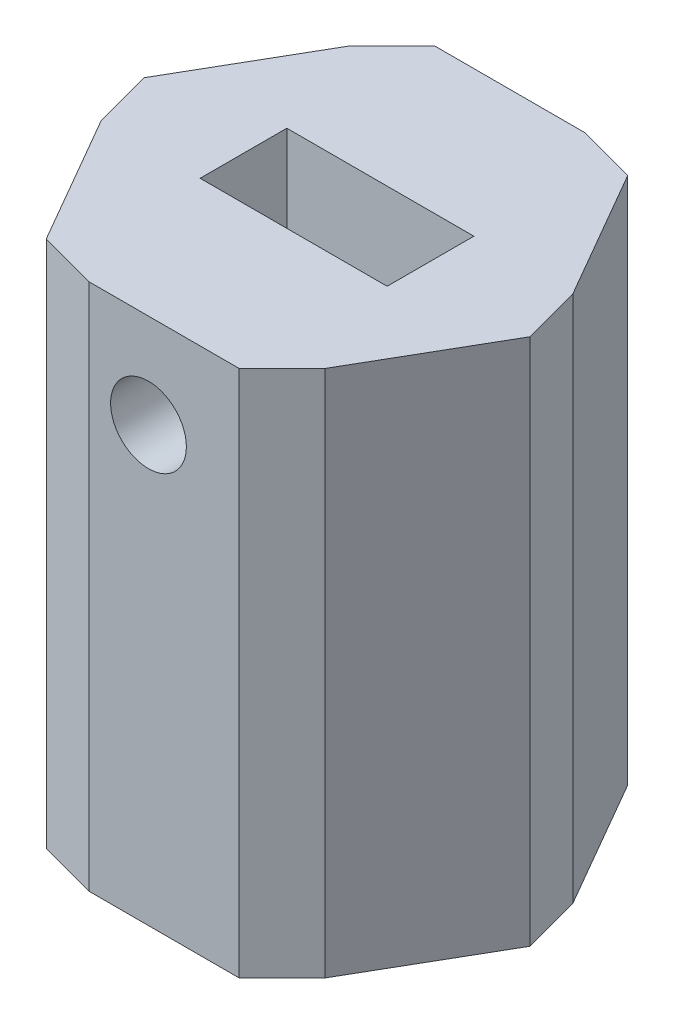
ISO-10303-21;
HEADER;
FILE_DESCRIPTION(('STEP AP214'),'2;1');
FILE_NAME('part.step','',(''),(''),'','','');
FILE_SCHEMA(('AUTOMOTIVE_DESIGN { 1 0 10303 214 1 1 1 1 }'));
ENDSEC;
DATA;
#1=APPLICATION_CONTEXT('core data for automotive mechanical design processes');
#2=APPLICATION_PROTOCOL_DEFINITION('international standard','automotive_design',2000,#1);
#3=PRODUCT_CONTEXT('',#1,'mechanical');
#4=PRODUCT('Part','Part','',(#3));
#5=PRODUCT_RELATED_PRODUCT_CATEGORY('part','',(#4));
#6=PRODUCT_DEFINITION_FORMATION('','',#4);
#7=PRODUCT_DEFINITION_CONTEXT('part definition',#1,'design');
#8=PRODUCT_DEFINITION('design','',#6,#7);
#9=PRODUCT_DEFINITION_SHAPE('','',#8);
#10=(LENGTH_UNIT() NAMED_UNIT(*) SI_UNIT(.MILLI.,.METRE.));
#11=(NAMED_UNIT(*) PLANE_ANGLE_UNIT() SI_UNIT($,.RADIAN.));
#12=(NAMED_UNIT(*) SI_UNIT($,.STERADIAN.) SOLID_ANGLE_UNIT());
#13=UNCERTAINTY_MEASURE_WITH_UNIT(LENGTH_MEASURE(1.E-05),#10,'distance_accuracy_value','');
#14=(GEOMETRIC_REPRESENTATION_CONTEXT(3) GLOBAL_UNCERTAINTY_ASSIGNED_CONTEXT((#13)) GLOBAL_UNIT_ASSIGNED_CONTEXT((#10,
#11,#12)) REPRESENTATION_CONTEXT('',''));
#15=CARTESIAN_POINT('',(0.,0.,0.));
#16=DIRECTION('',(0.,0.,1.));
#17=DIRECTION('',(1.,0.,0.));
#18=AXIS2_PLACEMENT_3D('',#15,#16,#17);
#19=CARTESIAN_POINT('',(-7.33234841870825,35.56,-12.7));
#20=DIRECTION('',(0.866025403784439,0.,0.5));
#21=DIRECTION('',(0.5,0.,-0.866025403784439));
#22=AXIS2_PLACEMENT_3D('',#19,#20,#21);
#23=PLANE('',#22);
#24=DIRECTION('',(-0.5,0.,0.866025403784439));
#25=VECTOR('',#24,1.);
#26=CARTESIAN_POINT('',(-7.33234841870825,35.56,-12.7));
#27=LINE('',#26,#25);
#28=CARTESIAN_POINT('',(-8.99780659100225,35.56,-9.81534182770601));
#29=VERTEX_POINT('',#28);
#30=CARTESIAN_POINT('',(-14.0550968374165,35.56,-1.05585817229399));
#31=VERTEX_POINT('',#30);
#32=EDGE_CURVE('E257',#29,#31,#27,.T.);
#33=ORIENTED_EDGE('',*,*,#32,.F.);
#34=DIRECTION('',(0.,-1.,0.));
#35=VECTOR('',#34,1.);
#36=CARTESIAN_POINT('',(-8.99780659100225,35.56,-9.81534182770601));
#37=LINE('',#36,#35);
#38=CARTESIAN_POINT('',(-8.99780659100225,0.,-9.81534182770601));
#39=VERTEX_POINT('',#38);
#40=EDGE_CURVE('E294',#29,#39,#37,.T.);
#41=ORIENTED_EDGE('',*,*,#40,.T.);
#42=DIRECTION('',(-0.5,0.,0.866025403784439));
#43=VECTOR('',#42,1.);
#44=CARTESIAN_POINT('',(-7.33234841870825,0.,-12.7));
#45=LINE('',#44,#43);
#46=CARTESIAN_POINT('',(-14.0550968374165,0.,-1.05585817229399));
#47=VERTEX_POINT('',#46);
#48=EDGE_CURVE('E253',#39,#47,#45,.T.);
#49=ORIENTED_EDGE('',*,*,#48,.T.);
#50=DIRECTION('',(0.,1.,0.));
#51=VECTOR('',#50,1.);
#52=CARTESIAN_POINT('',(-14.0550968374165,35.56,-1.05585817229399));
#53=LINE('',#52,#51);
#54=EDGE_CURVE('E276',#47,#31,#53,.T.);
#55=ORIENTED_EDGE('',*,*,#54,.T.);
#56=EDGE_LOOP('',(#33,#41,#49,#55));
#57=FACE_BOUND('',#56,.T.);
#58=ADVANCED_FACE('F44',(#57),#23,.F.);
#59=CARTESIAN_POINT('',(-14.6646968374165,35.56,0.));
#60=DIRECTION('',(0.866025403784439,0.,-0.5));
#61=DIRECTION('',(-0.5,0.,-0.866025403784439));
#62=AXIS2_PLACEMENT_3D('',#59,#60,#61);
#63=PLANE('',#62);
#64=DIRECTION('',(0.5,0.,0.866025403784439));
#65=VECTOR('',#64,1.);
#66=CARTESIAN_POINT('',(-14.6646968374165,0.,0.));
#67=LINE('',#66,#65);
#68=CARTESIAN_POINT('',(-12.9992386651225,0.,2.88465817229398));
#69=VERTEX_POINT('',#68);
#70=CARTESIAN_POINT('',(-7.94194841870825,0.,11.644141827706));
#71=VERTEX_POINT('',#70);
#72=EDGE_CURVE('E279',#69,#71,#67,.T.);
#73=ORIENTED_EDGE('',*,*,#72,.T.);
#74=DIRECTION('',(0.,1.,0.));
#75=VECTOR('',#74,1.);
#76=CARTESIAN_POINT('',(-7.94194841870825,35.56,11.644141827706));
#77=LINE('',#76,#75);
#78=CARTESIAN_POINT('',(-7.94194841870825,35.56,11.644141827706));
#79=VERTEX_POINT('',#78);
#80=EDGE_CURVE('E344',#71,#79,#77,.T.);
#81=ORIENTED_EDGE('',*,*,#80,.T.);
#82=DIRECTION('',(0.5,0.,0.866025403784439));
#83=VECTOR('',#82,1.);
#84=CARTESIAN_POINT('',(-14.6646968374165,35.56,0.));
#85=LINE('',#84,#83);
#86=CARTESIAN_POINT('',(-12.9992386651225,35.56,2.88465817229398));
#87=VERTEX_POINT('',#86);
#88=EDGE_CURVE('E260',#87,#79,#85,.T.);
#89=ORIENTED_EDGE('',*,*,#88,.F.);
#90=DIRECTION('',(0.,-1.,0.));
#91=VECTOR('',#90,1.);
#92=CARTESIAN_POINT('',(-12.9992386651225,35.56,2.88465817229398));
#93=LINE('',#92,#91);
#94=EDGE_CURVE('E341',#87,#69,#93,.T.);
#95=ORIENTED_EDGE('',*,*,#94,.T.);
#96=EDGE_LOOP('',(#73,#81,#89,#95));
#97=FACE_BOUND('',#96,.T.);
#98=ADVANCED_FACE('F426',(#97),#63,.F.);
#99=CARTESIAN_POINT('',(-7.33234841870825,35.56,12.7));
#100=DIRECTION('',(0.,0.,-1.));
#101=DIRECTION('',(-1.,0.,0.));
#102=AXIS2_PLACEMENT_3D('',#99,#100,#101);
#103=PLANE('',#102);
#104=CARTESIAN_POINT('',(0.,29.21,12.7));
#105=DIRECTION('',(0.,0.,1.));
#106=DIRECTION('',(1.,0.,0.));
#107=AXIS2_PLACEMENT_3D('',#104,#105,#106);
#108=CIRCLE('',#107,2.55269999999999);
#109=CARTESIAN_POINT('',(2.55269999999999,29.21,12.7));
#110=VERTEX_POINT('',#109);
#111=EDGE_CURVE('E557',#110,#110,#108,.T.);
#112=ORIENTED_EDGE('',*,*,#111,.F.);
#113=EDGE_LOOP('',(#112));
#114=FACE_BOUND('',#113,.T.);
#115=DIRECTION('',(1.,0.,0.));
#116=VECTOR('',#115,1.);
#117=CARTESIAN_POINT('',(-7.33234841870825,0.,12.7));
#118=LINE('',#117,#116);
#119=CARTESIAN_POINT('',(-4.00143207412029,0.,12.7));
#120=VERTEX_POINT('',#119);
#121=CARTESIAN_POINT('',(6.11314841870824,0.,12.7));
#122=VERTEX_POINT('',#121);
#123=EDGE_CURVE('E282',#120,#122,#118,.T.);
#124=ORIENTED_EDGE('',*,*,#123,.T.);
#125=DIRECTION('',(0.,1.,0.));
#126=VECTOR('',#125,1.);
#127=CARTESIAN_POINT('',(6.11314841870824,35.56,12.7));
#128=LINE('',#127,#126);
#129=CARTESIAN_POINT('',(6.11314841870824,35.56,12.7));
#130=VERTEX_POINT('',#129);
#131=EDGE_CURVE('E339',#122,#130,#128,.T.);
#132=ORIENTED_EDGE('',*,*,#131,.T.);
#133=DIRECTION('',(1.,0.,0.));
#134=VECTOR('',#133,1.);
#135=CARTESIAN_POINT('',(-7.33234841870825,35.56,12.7));
#136=LINE('',#135,#134);
#137=CARTESIAN_POINT('',(-4.00143207412029,35.56,12.7));
#138=VERTEX_POINT('',#137);
#139=EDGE_CURVE('E264',#138,#130,#136,.T.);
#140=ORIENTED_EDGE('',*,*,#139,.F.);
#141=DIRECTION('',(0.,-1.,0.));
#142=VECTOR('',#141,1.);
#143=CARTESIAN_POINT('',(-4.00143207412029,35.56,12.7));
#144=LINE('',#143,#142);
#145=EDGE_CURVE('E336',#138,#120,#144,.T.);
#146=ORIENTED_EDGE('',*,*,#145,.T.);
#147=EDGE_LOOP('',(#124,#132,#140,#146));
#148=FACE_BOUND('',#147,.T.);
#149=ADVANCED_FACE('F432',(#114,#148),#103,.F.);
#150=CARTESIAN_POINT('',(7.33234841870825,35.56,12.7));
#151=DIRECTION('',(-0.866025403784439,0.,-0.5));
#152=DIRECTION('',(-0.5,0.,0.866025403784439));
#153=AXIS2_PLACEMENT_3D('',#150,#151,#152);
#154=PLANE('',#153);
#155=DIRECTION('',(0.5,0.,-0.866025403784439));
#156=VECTOR('',#155,1.);
#157=CARTESIAN_POINT('',(7.33234841870825,0.,12.7));
#158=LINE('',#157,#156);
#159=CARTESIAN_POINT('',(8.99780659100224,0.,9.81534182770602));
#160=VERTEX_POINT('',#159);
#161=CARTESIAN_POINT('',(14.0550968374165,0.,1.05585817229399));
#162=VERTEX_POINT('',#161);
#163=EDGE_CURVE('E285',#160,#162,#158,.T.);
#164=ORIENTED_EDGE('',*,*,#163,.T.);
#165=DIRECTION('',(0.,1.,0.));
#166=VECTOR('',#165,1.);
#167=CARTESIAN_POINT('',(14.0550968374165,35.56,1.05585817229399));
#168=LINE('',#167,#166);
#169=CARTESIAN_POINT('',(14.0550968374165,35.56,1.05585817229399));
#170=VERTEX_POINT('',#169);
#171=EDGE_CURVE('E334',#162,#170,#168,.T.);
#172=ORIENTED_EDGE('',*,*,#171,.T.);
#173=DIRECTION('',(0.5,0.,-0.866025403784439));
#174=VECTOR('',#173,1.);
#175=CARTESIAN_POINT('',(7.33234841870825,35.56,12.7));
#176=LINE('',#175,#174);
#177=CARTESIAN_POINT('',(8.99780659100224,35.56,9.81534182770602));
#178=VERTEX_POINT('',#177);
#179=EDGE_CURVE('E267',#178,#170,#176,.T.);
#180=ORIENTED_EDGE('',*,*,#179,.F.);
#181=DIRECTION('',(0.,-1.,0.));
#182=VECTOR('',#181,1.);
#183=CARTESIAN_POINT('',(8.99780659100224,35.56,9.81534182770602));
#184=LINE('',#183,#182);
#185=EDGE_CURVE('E331',#178,#160,#184,.T.);
#186=ORIENTED_EDGE('',*,*,#185,.T.);
#187=EDGE_LOOP('',(#164,#172,#180,#186));
#188=FACE_BOUND('',#187,.T.);
#189=ADVANCED_FACE('F546',(#188),#154,.F.);
#190=CARTESIAN_POINT('',(14.6646968374165,35.56,0.));
#191=DIRECTION('',(-0.866025403784438,0.,0.5));
#192=DIRECTION('',(0.5,0.,0.866025403784439));
#193=AXIS2_PLACEMENT_3D('',#190,#191,#192);
#194=PLANE('',#193);
#195=DIRECTION('',(-0.5,0.,-0.866025403784439));
#196=VECTOR('',#195,1.);
#197=CARTESIAN_POINT('',(14.6646968374165,0.,0.));
#198=LINE('',#197,#196);
#199=CARTESIAN_POINT('',(12.9992386651225,0.,-2.88465817229399));
#200=VERTEX_POINT('',#199);
#201=CARTESIAN_POINT('',(7.94194841870825,0.,-11.644141827706));
#202=VERTEX_POINT('',#201);
#203=EDGE_CURVE('E288',#200,#202,#198,.T.);
#204=ORIENTED_EDGE('',*,*,#203,.T.);
#205=DIRECTION('',(0.,1.,0.));
#206=VECTOR('',#205,1.);
#207=CARTESIAN_POINT('',(7.94194841870826,35.56,-11.644141827706));
#208=LINE('',#207,#206);
#209=CARTESIAN_POINT('',(7.94194841870825,35.56,-11.644141827706));
#210=VERTEX_POINT('',#209);
#211=EDGE_CURVE('E329',#202,#210,#208,.T.);
#212=ORIENTED_EDGE('',*,*,#211,.T.);
#213=DIRECTION('',(-0.5,0.,-0.866025403784439));
#214=VECTOR('',#213,1.);
#215=CARTESIAN_POINT('',(14.6646968374165,35.56,0.));
#216=LINE('',#215,#214);
#217=CARTESIAN_POINT('',(12.9992386651225,35.56,-2.88465817229399));
#218=VERTEX_POINT('',#217);
#219=EDGE_CURVE('E270',#218,#210,#216,.T.);
#220=ORIENTED_EDGE('',*,*,#219,.F.);
#221=DIRECTION('',(0.,-1.,0.));
#222=VECTOR('',#221,1.);
#223=CARTESIAN_POINT('',(12.9992386651225,35.56,-2.88465817229398));
#224=LINE('',#223,#222);
#225=EDGE_CURVE('E326',#218,#200,#224,.T.);
#226=ORIENTED_EDGE('',*,*,#225,.T.);
#227=EDGE_LOOP('',(#204,#212,#220,#226));
#228=FACE_BOUND('',#227,.T.);
#229=ADVANCED_FACE('F542',(#228),#194,.F.);
#230=CARTESIAN_POINT('',(7.33234841870825,35.56,-12.7));
#231=DIRECTION('',(0.,0.,1.));
#232=DIRECTION('',(1.,0.,0.));
#233=AXIS2_PLACEMENT_3D('',#230,#231,#232);
#234=PLANE('',#233);
#235=DIRECTION('',(-1.,0.,0.));
#236=VECTOR('',#235,1.);
#237=CARTESIAN_POINT('',(7.33234841870825,0.,-12.7));
#238=LINE('',#237,#236);
#239=CARTESIAN_POINT('',(4.0014320741203,0.,-12.7));
#240=VERTEX_POINT('',#239);
#241=CARTESIAN_POINT('',(-6.11314841870823,0.,-12.7));
#242=VERTEX_POINT('',#241);
#243=EDGE_CURVE('E261',#240,#242,#238,.T.);
#244=ORIENTED_EDGE('',*,*,#243,.T.);
#245=DIRECTION('',(0.,1.,0.));
#246=VECTOR('',#245,1.);
#247=CARTESIAN_POINT('',(-6.11314841870823,35.56,-12.7));
#248=LINE('',#247,#246);
#249=CARTESIAN_POINT('',(-6.11314841870823,35.56,-12.7));
#250=VERTEX_POINT('',#249);
#251=EDGE_CURVE('E312',#242,#250,#248,.T.);
#252=ORIENTED_EDGE('',*,*,#251,.T.);
#253=DIRECTION('',(-1.,0.,0.));
#254=VECTOR('',#253,1.);
#255=CARTESIAN_POINT('',(7.33234841870825,35.56,-12.7));
#256=LINE('',#255,#254);
#257=CARTESIAN_POINT('',(4.0014320741203,35.56,-12.7));
#258=VERTEX_POINT('',#257);
#259=EDGE_CURVE('E273',#258,#250,#256,.T.);
#260=ORIENTED_EDGE('',*,*,#259,.F.);
#261=DIRECTION('',(0.,-1.,0.));
#262=VECTOR('',#261,1.);
#263=CARTESIAN_POINT('',(4.0014320741203,35.56,-12.7));
#264=LINE('',#263,#262);
#265=EDGE_CURVE('E309',#258,#240,#264,.T.);
#266=ORIENTED_EDGE('',*,*,#265,.T.);
#267=EDGE_LOOP('',(#244,#252,#260,#266));
#268=FACE_BOUND('',#267,.T.);
#269=ADVANCED_FACE('F536',(#268),#234,.F.);
#270=CARTESIAN_POINT('',(0.,35.56,0.));
#271=DIRECTION('',(0.,1.,0.));
#272=DIRECTION('',(0.,0.,1.));
#273=AXIS2_PLACEMENT_3D('',#270,#271,#272);
#274=PLANE('',#273);
#275=DIRECTION('',(0.,0.,1.));
#276=VECTOR('',#275,1.);
#277=CARTESIAN_POINT('',(-6.29974777524748,35.56,-2.921));
#278=LINE('',#277,#276);
#279=CARTESIAN_POINT('',(-6.29974777524748,35.56,-2.921));
#280=VERTEX_POINT('',#279);
#281=CARTESIAN_POINT('',(-6.29974777524748,35.56,2.921));
#282=VERTEX_POINT('',#281);
#283=EDGE_CURVE('E217',#280,#282,#278,.T.);
#284=ORIENTED_EDGE('',*,*,#283,.F.);
#285=DIRECTION('',(-1.,0.,0.));
#286=VECTOR('',#285,1.);
#287=CARTESIAN_POINT('',(6.29974777524748,35.56,-2.921));
#288=LINE('',#287,#286);
#289=CARTESIAN_POINT('',(6.29974777524748,35.56,-2.921));
#290=VERTEX_POINT('',#289);
#291=EDGE_CURVE('E234',#290,#280,#288,.T.);
#292=ORIENTED_EDGE('',*,*,#291,.F.);
#293=DIRECTION('',(0.,0.,-1.));
#294=VECTOR('',#293,1.);
#295=CARTESIAN_POINT('',(6.29974777524748,35.56,-2.921));
#296=LINE('',#295,#294);
#297=CARTESIAN_POINT('',(6.29974777524748,35.56,2.921));
#298=VERTEX_POINT('',#297);
#299=EDGE_CURVE('E237',#298,#290,#296,.T.);
#300=ORIENTED_EDGE('',*,*,#299,.F.);
#301=DIRECTION('',(1.,0.,0.));
#302=VECTOR('',#301,1.);
#303=CARTESIAN_POINT('',(6.29974777524748,35.56,2.921));
#304=LINE('',#303,#302);
#305=EDGE_CURVE('E246',#282,#298,#304,.T.);
#306=ORIENTED_EDGE('',*,*,#305,.F.);
#307=EDGE_LOOP('',(#284,#292,#300,#306));
#308=FACE_BOUND('',#307,.T.);
#309=ORIENTED_EDGE('',*,*,#259,.T.);
#310=DIRECTION('',(0.707106781186549,0.,-0.707106781186546));
#311=VECTOR('',#310,1.);
#312=CARTESIAN_POINT('',(-9.40657420935411,35.56,-9.40657420935415));
#313=LINE('',#312,#311);
#314=EDGE_CURVE('E324',#250,#29,#313,.F.);
#315=ORIENTED_EDGE('',*,*,#314,.T.);
#316=ORIENTED_EDGE('',*,*,#32,.T.);
#317=DIRECTION('',(-0.25881904510252,0.,-0.965925826289069));
#318=VECTOR('',#317,1.);
#319=CARTESIAN_POINT('',(-12.8496193325613,35.56,3.44304512320712));
#320=LINE('',#319,#318);
#321=EDGE_CURVE('E314',#31,#87,#320,.F.);
#322=ORIENTED_EDGE('',*,*,#321,.T.);
#323=ORIENTED_EDGE('',*,*,#88,.T.);
#324=DIRECTION('',(-0.965925826289068,0.,-0.258819045102522));
#325=VECTOR('',#324,1.);
#326=CARTESIAN_POINT('',(-3.44304512320715,35.56,12.8496193325613));
#327=LINE('',#326,#325);
#328=EDGE_CURVE('E316',#79,#138,#327,.F.);
#329=ORIENTED_EDGE('',*,*,#328,.T.);
#330=ORIENTED_EDGE('',*,*,#139,.T.);
#331=DIRECTION('',(-0.707106781186548,0.,0.707106781186547));
#332=VECTOR('',#331,1.);
#333=CARTESIAN_POINT('',(9.40657420935412,35.56,9.40657420935414));
#334=LINE('',#333,#332);
#335=EDGE_CURVE('E318',#130,#178,#334,.F.);
#336=ORIENTED_EDGE('',*,*,#335,.T.);
#337=ORIENTED_EDGE('',*,*,#179,.T.);
#338=DIRECTION('',(0.25881904510252,0.,0.965925826289069));
#339=VECTOR('',#338,1.);
#340=CARTESIAN_POINT('',(12.8496193325613,35.56,-3.44304512320712));
#341=LINE('',#340,#339);
#342=EDGE_CURVE('E320',#170,#218,#341,.F.);
#343=ORIENTED_EDGE('',*,*,#342,.T.);
#344=ORIENTED_EDGE('',*,*,#219,.T.);
#345=DIRECTION('',(0.965925826289068,0.,0.258819045102523));
#346=VECTOR('',#345,1.);
#347=CARTESIAN_POINT('',(3.44304512320717,35.56,-12.8496193325613));
#348=LINE('',#347,#346);
#349=EDGE_CURVE('E322',#210,#258,#348,.F.);
#350=ORIENTED_EDGE('',*,*,#349,.T.);
#351=EDGE_LOOP('',(#309,#315,#316,#322,#323,#329,#330,#336,#337,#343,#344,#350));
#352=FACE_BOUND('',#351,.T.);
#353=ADVANCED_FACE('F533',(#308,#352),#274,.T.);
#354=CARTESIAN_POINT('',(0.,0.,0.));
#355=DIRECTION('',(0.,1.,0.));
#356=DIRECTION('',(0.,0.,1.));
#357=AXIS2_PLACEMENT_3D('',#354,#355,#356);
#358=PLANE('',#357);
#359=DIRECTION('',(0.707106781186547,0.,0.707106781186548));
#360=VECTOR('',#359,1.);
#361=CARTESIAN_POINT('',(6.46578440716979,0.,0.));
#362=LINE('',#361,#360);
#363=CARTESIAN_POINT('',(0.862104587622653,0.,-5.60367981954714));
#364=VERTEX_POINT('',#363);
#365=CARTESIAN_POINT('',(5.60367981954716,0.,-0.862104587622634));
#366=VERTEX_POINT('',#365);
#367=EDGE_CURVE('E410',#364,#366,#362,.T.);
#368=ORIENTED_EDGE('',*,*,#367,.F.);
#369=DIRECTION('',(1.,0.,0.));
#370=VECTOR('',#369,1.);
#371=CARTESIAN_POINT('',(0.,0.,-5.60367981954715));
#372=LINE('',#371,#370);
#373=CARTESIAN_POINT('',(-0.862104587622638,0.,-5.60367981954715));
#374=VERTEX_POINT('',#373);
#375=EDGE_CURVE('E372',#364,#374,#372,.F.);
#376=ORIENTED_EDGE('',*,*,#375,.T.);
#377=DIRECTION('',(0.707106781186548,0.,-0.707106781186547));
#378=VECTOR('',#377,1.);
#379=CARTESIAN_POINT('',(-6.46578440716979,0.,0.));
#380=LINE('',#379,#378);
#381=CARTESIAN_POINT('',(-5.60367981954715,0.,-0.862104587622642));
#382=VERTEX_POINT('',#381);
#383=EDGE_CURVE('E382',#382,#374,#380,.T.);
#384=ORIENTED_EDGE('',*,*,#383,.F.);
#385=DIRECTION('',(0.,0.,-1.));
#386=VECTOR('',#385,1.);
#387=CARTESIAN_POINT('',(-5.60367981954715,0.,0.));
#388=LINE('',#387,#386);
#389=CARTESIAN_POINT('',(-5.60367981954716,0.,0.862104587622631));
#390=VERTEX_POINT('',#389);
#391=EDGE_CURVE('E53',#382,#390,#388,.F.);
#392=ORIENTED_EDGE('',*,*,#391,.T.);
#393=DIRECTION('',(-0.707106781186547,0.,-0.707106781186548));
#394=VECTOR('',#393,1.);
#395=CARTESIAN_POINT('',(0.,0.,6.46578440716979));
#396=LINE('',#395,#394);
#397=CARTESIAN_POINT('',(-0.862104587622642,0.,5.60367981954715));
#398=VERTEX_POINT('',#397);
#399=EDGE_CURVE('E240',#398,#390,#396,.T.);
#400=ORIENTED_EDGE('',*,*,#399,.F.);
#401=DIRECTION('',(-1.,0.,0.));
#402=VECTOR('',#401,1.);
#403=CARTESIAN_POINT('',(0.,0.,5.60367981954715));
#404=LINE('',#403,#402);
#405=CARTESIAN_POINT('',(0.862104587622632,0.,5.60367981954716));
#406=VERTEX_POINT('',#405);
#407=EDGE_CURVE('E11',#398,#406,#404,.F.);
#408=ORIENTED_EDGE('',*,*,#407,.T.);
#409=DIRECTION('',(-0.707106781186548,0.,0.707106781186547));
#410=VECTOR('',#409,1.);
#411=CARTESIAN_POINT('',(0.,0.,6.46578440716979));
#412=LINE('',#411,#410);
#413=CARTESIAN_POINT('',(5.60367981954715,0.,0.862104587622646));
#414=VERTEX_POINT('',#413);
#415=EDGE_CURVE('E388',#414,#406,#412,.T.);
#416=ORIENTED_EDGE('',*,*,#415,.F.);
#417=DIRECTION('',(0.,0.,1.));
#418=VECTOR('',#417,1.);
#419=CARTESIAN_POINT('',(5.60367981954715,0.,0.));
#420=LINE('',#419,#418);
#421=EDGE_CURVE('E374',#414,#366,#420,.F.);
#422=ORIENTED_EDGE('',*,*,#421,.T.);
#423=EDGE_LOOP('',(#368,#376,#384,#392,#400,#408,#416,#422));
#424=FACE_BOUND('',#423,.T.);
#425=ORIENTED_EDGE('',*,*,#48,.F.);
#426=DIRECTION('',(-0.707106781186549,0.,0.707106781186546));
#427=VECTOR('',#426,1.);
#428=CARTESIAN_POINT('',(-8.99780659100225,0.,-9.81534182770601));
#429=LINE('',#428,#427);
#430=EDGE_CURVE('E307',#39,#242,#429,.F.);
#431=ORIENTED_EDGE('',*,*,#430,.T.);
#432=ORIENTED_EDGE('',*,*,#243,.F.);
#433=DIRECTION('',(-0.965925826289068,0.,-0.258819045102523));
#434=VECTOR('',#433,1.);
#435=CARTESIAN_POINT('',(4.0014320741203,0.,-12.7));
#436=LINE('',#435,#434);
#437=EDGE_CURVE('E305',#240,#202,#436,.F.);
#438=ORIENTED_EDGE('',*,*,#437,.T.);
#439=ORIENTED_EDGE('',*,*,#203,.F.);
#440=DIRECTION('',(-0.25881904510252,0.,-0.965925826289069));
#441=VECTOR('',#440,1.);
#442=CARTESIAN_POINT('',(12.9992386651225,0.,-2.88465817229398));
#443=LINE('',#442,#441);
#444=EDGE_CURVE('E303',#200,#162,#443,.F.);
#445=ORIENTED_EDGE('',*,*,#444,.T.);
#446=ORIENTED_EDGE('',*,*,#163,.F.);
#447=DIRECTION('',(0.707106781186548,0.,-0.707106781186547));
#448=VECTOR('',#447,1.);
#449=CARTESIAN_POINT('',(8.99780659100224,0.,9.81534182770602));
#450=LINE('',#449,#448);
#451=EDGE_CURVE('E301',#160,#122,#450,.F.);
#452=ORIENTED_EDGE('',*,*,#451,.T.);
#453=ORIENTED_EDGE('',*,*,#123,.F.);
#454=DIRECTION('',(0.965925826289068,0.,0.258819045102522));
#455=VECTOR('',#454,1.);
#456=CARTESIAN_POINT('',(-4.00143207412029,0.,12.7));
#457=LINE('',#456,#455);
#458=EDGE_CURVE('E299',#120,#71,#457,.F.);
#459=ORIENTED_EDGE('',*,*,#458,.T.);
#460=ORIENTED_EDGE('',*,*,#72,.F.);
#461=DIRECTION('',(0.25881904510252,0.,0.965925826289069));
#462=VECTOR('',#461,1.);
#463=CARTESIAN_POINT('',(-12.9992386651225,0.,2.88465817229398));
#464=LINE('',#463,#462);
#465=EDGE_CURVE('E297',#69,#47,#464,.F.);
#466=ORIENTED_EDGE('',*,*,#465,.T.);
#467=EDGE_LOOP('',(#425,#431,#432,#438,#439,#445,#446,#452,#453,#459,#460,#466));
#468=FACE_BOUND('',#467,.T.);
#469=ADVANCED_FACE('F379',(#424,#468),#358,.F.);
#470=CARTESIAN_POINT('',(-6.29974777524748,22.86,-2.921));
#471=DIRECTION('',(-1.,0.,0.));
#472=DIRECTION('',(0.,0.,1.));
#473=AXIS2_PLACEMENT_3D('',#470,#471,#472);
#474=PLANE('',#473);
#475=ORIENTED_EDGE('',*,*,#283,.T.);
#476=DIRECTION('',(0.,1.,0.));
#477=VECTOR('',#476,1.);
#478=CARTESIAN_POINT('',(-6.29974777524748,22.86,2.921));
#479=LINE('',#478,#477);
#480=CARTESIAN_POINT('',(-6.29974777524748,22.86,2.921));
#481=VERTEX_POINT('',#480);
#482=EDGE_CURVE('E210',#481,#282,#479,.T.);
#483=ORIENTED_EDGE('',*,*,#482,.F.);
#484=DIRECTION('',(0.,0.,1.));
#485=VECTOR('',#484,1.);
#486=CARTESIAN_POINT('',(-6.29974777524748,22.86,-2.921));
#487=LINE('',#486,#485);
#488=CARTESIAN_POINT('',(-6.29974777524748,22.86,-2.921));
#489=VERTEX_POINT('',#488);
#490=EDGE_CURVE('E214',#489,#481,#487,.T.);
#491=ORIENTED_EDGE('',*,*,#490,.F.);
#492=DIRECTION('',(0.,1.,0.));
#493=VECTOR('',#492,1.);
#494=CARTESIAN_POINT('',(-6.29974777524748,22.86,-2.921));
#495=LINE('',#494,#493);
#496=EDGE_CURVE('E251',#489,#280,#495,.T.);
#497=ORIENTED_EDGE('',*,*,#496,.T.);
#498=EDGE_LOOP('',(#475,#483,#491,#497));
#499=FACE_BOUND('',#498,.T.);
#500=ADVANCED_FACE('F212',(#499),#474,.F.);
#501=CARTESIAN_POINT('',(6.29974777524748,22.86,-2.921));
#502=DIRECTION('',(0.,0.,-1.));
#503=DIRECTION('',(-1.,0.,0.));
#504=AXIS2_PLACEMENT_3D('',#501,#502,#503);
#505=PLANE('',#504);
#506=CARTESIAN_POINT('',(0.,29.21,-2.921));
#507=VERTEX_POINT('',#506);
#508=VERTEX_LOOP('',#507);
#509=FACE_BOUND('',#508,.T.);
#510=ORIENTED_EDGE('',*,*,#291,.T.);
#511=ORIENTED_EDGE('',*,*,#496,.F.);
#512=DIRECTION('',(-1.,0.,0.));
#513=VECTOR('',#512,1.);
#514=CARTESIAN_POINT('',(6.29974777524748,22.86,-2.921));
#515=LINE('',#514,#513);
#516=CARTESIAN_POINT('',(6.29974777524748,22.86,-2.921));
#517=VERTEX_POINT('',#516);
#518=EDGE_CURVE('E222',#517,#489,#515,.T.);
#519=ORIENTED_EDGE('',*,*,#518,.F.);
#520=DIRECTION('',(0.,1.,0.));
#521=VECTOR('',#520,1.);
#522=CARTESIAN_POINT('',(6.29974777524748,22.86,-2.921));
#523=LINE('',#522,#521);
#524=EDGE_CURVE('E254',#517,#290,#523,.T.);
#525=ORIENTED_EDGE('',*,*,#524,.T.);
#526=EDGE_LOOP('',(#510,#511,#519,#525));
#527=FACE_BOUND('',#526,.T.);
#528=ADVANCED_FACE('F520',(#509,#527),#505,.F.);
#529=CARTESIAN_POINT('',(6.29974777524748,22.86,-2.921));
#530=DIRECTION('',(1.,0.,0.));
#531=DIRECTION('',(0.,0.,-1.));
#532=AXIS2_PLACEMENT_3D('',#529,#530,#531);
#533=PLANE('',#532);
#534=ORIENTED_EDGE('',*,*,#299,.T.);
#535=ORIENTED_EDGE('',*,*,#524,.F.);
#536=DIRECTION('',(0.,0.,-1.));
#537=VECTOR('',#536,1.);
#538=CARTESIAN_POINT('',(6.29974777524748,22.86,-2.921));
#539=LINE('',#538,#537);
#540=CARTESIAN_POINT('',(6.29974777524748,22.86,2.921));
#541=VERTEX_POINT('',#540);
#542=EDGE_CURVE('E230',#541,#517,#539,.T.);
#543=ORIENTED_EDGE('',*,*,#542,.F.);
#544=DIRECTION('',(0.,1.,0.));
#545=VECTOR('',#544,1.);
#546=CARTESIAN_POINT('',(6.29974777524748,22.86,2.921));
#547=LINE('',#546,#545);
#548=EDGE_CURVE('E221',#541,#298,#547,.T.);
#549=ORIENTED_EDGE('',*,*,#548,.T.);
#550=EDGE_LOOP('',(#534,#535,#543,#549));
#551=FACE_BOUND('',#550,.T.);
#552=ADVANCED_FACE('F523',(#551),#533,.F.);
#553=CARTESIAN_POINT('',(6.29974777524748,22.86,2.921));
#554=DIRECTION('',(0.,0.,1.));
#555=DIRECTION('',(1.,0.,0.));
#556=AXIS2_PLACEMENT_3D('',#553,#554,#555);
#557=PLANE('',#556);
#558=CARTESIAN_POINT('',(0.,29.21,2.921));
#559=DIRECTION('',(0.,0.,1.));
#560=DIRECTION('',(1.,0.,0.));
#561=AXIS2_PLACEMENT_3D('',#558,#559,#560);
#562=CIRCLE('',#561,2.55269999999999);
#563=CARTESIAN_POINT('',(2.55269999999999,29.21,2.921));
#564=VERTEX_POINT('',#563);
#565=EDGE_CURVE('E404',#564,#564,#562,.T.);
#566=ORIENTED_EDGE('',*,*,#565,.T.);
#567=EDGE_LOOP('',(#566));
#568=FACE_BOUND('',#567,.T.);
#569=ORIENTED_EDGE('',*,*,#305,.T.);
#570=ORIENTED_EDGE('',*,*,#548,.F.);
#571=DIRECTION('',(1.,0.,0.));
#572=VECTOR('',#571,1.);
#573=CARTESIAN_POINT('',(6.29974777524748,22.86,2.921));
#574=LINE('',#573,#572);
#575=EDGE_CURVE('E225',#481,#541,#574,.T.);
#576=ORIENTED_EDGE('',*,*,#575,.F.);
#577=ORIENTED_EDGE('',*,*,#482,.T.);
#578=EDGE_LOOP('',(#569,#570,#576,#577));
#579=FACE_BOUND('',#578,.T.);
#580=ADVANCED_FACE('F226',(#568,#579),#557,.F.);
#581=CARTESIAN_POINT('',(0.,22.86,0.));
#582=DIRECTION('',(0.,-1.,0.));
#583=DIRECTION('',(0.,0.,-1.));
#584=AXIS2_PLACEMENT_3D('',#581,#582,#583);
#585=PLANE('',#584);
#586=ORIENTED_EDGE('',*,*,#490,.T.);
#587=ORIENTED_EDGE('',*,*,#575,.T.);
#588=ORIENTED_EDGE('',*,*,#542,.T.);
#589=ORIENTED_EDGE('',*,*,#518,.T.);
#590=EDGE_LOOP('',(#586,#587,#588,#589));
#591=FACE_BOUND('',#590,.T.);
#592=ADVANCED_FACE('F232',(#591),#585,.F.);
#593=CARTESIAN_POINT('',(-6.46578440716979,12.7,0.));
#594=DIRECTION('',(-0.707106781186547,0.,-0.707106781186548));
#595=DIRECTION('',(-0.707106781186548,0.,0.707106781186547));
#596=AXIS2_PLACEMENT_3D('',#593,#594,#595);
#597=PLANE('',#596);
#598=ORIENTED_EDGE('',*,*,#383,.T.);
#599=DIRECTION('',(0.,1.,0.));
#600=VECTOR('',#599,1.);
#601=CARTESIAN_POINT('',(-0.862104587622636,12.7,-5.60367981954715));
#602=LINE('',#601,#600);
#603=CARTESIAN_POINT('',(-0.862104587622638,12.7,-5.60367981954715));
#604=VERTEX_POINT('',#603);
#605=EDGE_CURVE('E354',#374,#604,#602,.T.);
#606=ORIENTED_EDGE('',*,*,#605,.T.);
#607=DIRECTION('',(0.707106781186548,0.,-0.707106781186547));
#608=VECTOR('',#607,1.);
#609=CARTESIAN_POINT('',(-6.46578440716979,12.7,0.));
#610=LINE('',#609,#608);
#611=CARTESIAN_POINT('',(-5.60367981954715,12.7,-0.862104587622642));
#612=VERTEX_POINT('',#611);
#613=EDGE_CURVE('E387',#612,#604,#610,.T.);
#614=ORIENTED_EDGE('',*,*,#613,.F.);
#615=DIRECTION('',(0.,-1.,0.));
#616=VECTOR('',#615,1.);
#617=CARTESIAN_POINT('',(-5.60367981954715,0.,-0.862104587622642));
#618=LINE('',#617,#616);
#619=EDGE_CURVE('E351',#612,#382,#618,.T.);
#620=ORIENTED_EDGE('',*,*,#619,.T.);
#621=EDGE_LOOP('',(#598,#606,#614,#620));
#622=FACE_BOUND('',#621,.T.);
#623=ADVANCED_FACE('F396',(#622),#597,.F.);
#624=CARTESIAN_POINT('',(0.,12.7,6.46578440716979));
#625=DIRECTION('',(-0.707106781186548,0.,0.707106781186547));
#626=DIRECTION('',(0.707106781186547,0.,0.707106781186548));
#627=AXIS2_PLACEMENT_3D('',#624,#625,#626);
#628=PLANE('',#627);
#629=ORIENTED_EDGE('',*,*,#399,.T.);
#630=DIRECTION('',(0.,1.,0.));
#631=VECTOR('',#630,1.);
#632=CARTESIAN_POINT('',(-5.60367981954716,12.7,0.862104587622631));
#633=LINE('',#632,#631);
#634=CARTESIAN_POINT('',(-5.60367981954716,12.7,0.862104587622631));
#635=VERTEX_POINT('',#634);
#636=EDGE_CURVE('E60',#390,#635,#633,.T.);
#637=ORIENTED_EDGE('',*,*,#636,.T.);
#638=DIRECTION('',(-0.707106781186547,0.,-0.707106781186548));
#639=VECTOR('',#638,1.);
#640=CARTESIAN_POINT('',(0.,12.7,6.46578440716979));
#641=LINE('',#640,#639);
#642=CARTESIAN_POINT('',(-0.862104587622642,12.7,5.60367981954715));
#643=VERTEX_POINT('',#642);
#644=EDGE_CURVE('E247',#643,#635,#641,.T.);
#645=ORIENTED_EDGE('',*,*,#644,.F.);
#646=DIRECTION('',(0.,-1.,0.));
#647=VECTOR('',#646,1.);
#648=CARTESIAN_POINT('',(-0.862104587622642,0.,5.60367981954715));
#649=LINE('',#648,#647);
#650=EDGE_CURVE('E368',#643,#398,#649,.T.);
#651=ORIENTED_EDGE('',*,*,#650,.T.);
#652=EDGE_LOOP('',(#629,#637,#645,#651));
#653=FACE_BOUND('',#652,.T.);
#654=ADVANCED_FACE('F385',(#653),#628,.F.);
#655=CARTESIAN_POINT('',(0.,12.7,6.46578440716979));
#656=DIRECTION('',(0.707106781186547,0.,0.707106781186548));
#657=DIRECTION('',(0.707106781186548,0.,-0.707106781186547));
#658=AXIS2_PLACEMENT_3D('',#655,#656,#657);
#659=PLANE('',#658);
#660=DIRECTION('',(-0.707106781186548,0.,0.707106781186547));
#661=VECTOR('',#660,1.);
#662=CARTESIAN_POINT('',(0.,12.7,6.46578440716979));
#663=LINE('',#662,#661);
#664=CARTESIAN_POINT('',(5.60367981954715,12.7,0.862104587622646));
#665=VERTEX_POINT('',#664);
#666=CARTESIAN_POINT('',(0.862104587622632,12.7,5.60367981954716));
#667=VERTEX_POINT('',#666);
#668=EDGE_CURVE('E401',#665,#667,#663,.T.);
#669=ORIENTED_EDGE('',*,*,#668,.F.);
#670=DIRECTION('',(0.,-1.,0.));
#671=VECTOR('',#670,1.);
#672=CARTESIAN_POINT('',(5.60367981954715,0.,0.862104587622645));
#673=LINE('',#672,#671);
#674=EDGE_CURVE('E365',#665,#414,#673,.T.);
#675=ORIENTED_EDGE('',*,*,#674,.T.);
#676=ORIENTED_EDGE('',*,*,#415,.T.);
#677=DIRECTION('',(0.,1.,0.));
#678=VECTOR('',#677,1.);
#679=CARTESIAN_POINT('',(0.862104587622632,12.7,5.60367981954716));
#680=LINE('',#679,#678);
#681=EDGE_CURVE('E363',#406,#667,#680,.T.);
#682=ORIENTED_EDGE('',*,*,#681,.T.);
#683=EDGE_LOOP('',(#669,#675,#676,#682));
#684=FACE_BOUND('',#683,.T.);
#685=ADVANCED_FACE('F417',(#684),#659,.F.);
#686=CARTESIAN_POINT('',(6.46578440716979,12.7,0.));
#687=DIRECTION('',(0.707106781186548,0.,-0.707106781186547));
#688=DIRECTION('',(-0.707106781186547,0.,-0.707106781186548));
#689=AXIS2_PLACEMENT_3D('',#686,#687,#688);
#690=PLANE('',#689);
#691=DIRECTION('',(0.707106781186547,0.,0.707106781186548));
#692=VECTOR('',#691,1.);
#693=CARTESIAN_POINT('',(6.46578440716979,12.7,0.));
#694=LINE('',#693,#692);
#695=CARTESIAN_POINT('',(0.862104587622653,12.7,-5.60367981954714));
#696=VERTEX_POINT('',#695);
#697=CARTESIAN_POINT('',(5.60367981954716,12.7,-0.862104587622634));
#698=VERTEX_POINT('',#697);
#699=EDGE_CURVE('E398',#696,#698,#694,.T.);
#700=ORIENTED_EDGE('',*,*,#699,.F.);
#701=DIRECTION('',(0.,-1.,0.));
#702=VECTOR('',#701,1.);
#703=CARTESIAN_POINT('',(0.862104587622651,0.,-5.60367981954714));
#704=LINE('',#703,#702);
#705=EDGE_CURVE('E348',#696,#364,#704,.T.);
#706=ORIENTED_EDGE('',*,*,#705,.T.);
#707=ORIENTED_EDGE('',*,*,#367,.T.);
#708=DIRECTION('',(0.,1.,0.));
#709=VECTOR('',#708,1.);
#710=CARTESIAN_POINT('',(5.60367981954716,12.7,-0.862104587622634));
#711=LINE('',#710,#709);
#712=EDGE_CURVE('E346',#366,#698,#711,.T.);
#713=ORIENTED_EDGE('',*,*,#712,.T.);
#714=EDGE_LOOP('',(#700,#706,#707,#713));
#715=FACE_BOUND('',#714,.T.);
#716=ADVANCED_FACE('F505',(#715),#690,.F.);
#717=CARTESIAN_POINT('',(0.,12.7,0.));
#718=DIRECTION('',(0.,1.,0.));
#719=DIRECTION('',(0.,0.,1.));
#720=AXIS2_PLACEMENT_3D('',#717,#718,#719);
#721=PLANE('',#720);
#722=ORIENTED_EDGE('',*,*,#613,.T.);
#723=DIRECTION('',(-1.,0.,0.));
#724=VECTOR('',#723,1.);
#725=CARTESIAN_POINT('',(0.862104587622652,12.7,-5.60367981954714));
#726=LINE('',#725,#724);
#727=EDGE_CURVE('E361',#604,#696,#726,.F.);
#728=ORIENTED_EDGE('',*,*,#727,.T.);
#729=ORIENTED_EDGE('',*,*,#699,.T.);
#730=DIRECTION('',(0.,0.,-1.));
#731=VECTOR('',#730,1.);
#732=CARTESIAN_POINT('',(5.60367981954715,12.7,0.862104587622645));
#733=LINE('',#732,#731);
#734=EDGE_CURVE('E359',#698,#665,#733,.F.);
#735=ORIENTED_EDGE('',*,*,#734,.T.);
#736=ORIENTED_EDGE('',*,*,#668,.T.);
#737=DIRECTION('',(1.,0.,0.));
#738=VECTOR('',#737,1.);
#739=CARTESIAN_POINT('',(-0.862104587622642,12.7,5.60367981954715));
#740=LINE('',#739,#738);
#741=EDGE_CURVE('E67',#667,#643,#740,.F.);
#742=ORIENTED_EDGE('',*,*,#741,.T.);
#743=ORIENTED_EDGE('',*,*,#644,.T.);
#744=DIRECTION('',(0.,0.,1.));
#745=VECTOR('',#744,1.);
#746=CARTESIAN_POINT('',(-5.60367981954715,12.7,-0.862104587622642));
#747=LINE('',#746,#745);
#748=EDGE_CURVE('E357',#635,#612,#747,.F.);
#749=ORIENTED_EDGE('',*,*,#748,.T.);
#750=EDGE_LOOP('',(#722,#728,#729,#735,#736,#742,#743,#749));
#751=FACE_BOUND('',#750,.T.);
#752=ADVANCED_FACE('F393',(#751),#721,.F.);
#753=CARTESIAN_POINT('',(0.,29.21,12.7));
#754=DIRECTION('',(0.,0.,1.));
#755=DIRECTION('',(1.,0.,0.));
#756=AXIS2_PLACEMENT_3D('',#753,#754,#755);
#757=CYLINDRICAL_SURFACE('',#756,2.55269999999999);
#758=ORIENTED_EDGE('',*,*,#111,.T.);
#759=EDGE_LOOP('',(#758));
#760=FACE_BOUND('',#759,.T.);
#761=ORIENTED_EDGE('',*,*,#565,.F.);
#762=EDGE_LOOP('',(#761));
#763=FACE_BOUND('',#762,.T.);
#764=ADVANCED_FACE('F446',(#760,#763),#757,.F.);
#765=CARTESIAN_POINT('',(-8.99780659100225,35.56,-9.81534182770601));
#766=DIRECTION('',(0.707106781186546,0.,0.707106781186549));
#767=DIRECTION('',(0.,-1.,0.));
#768=AXIS2_PLACEMENT_3D('',#765,#766,#767);
#769=PLANE('',#768);
#770=ORIENTED_EDGE('',*,*,#314,.F.);
#771=ORIENTED_EDGE('',*,*,#251,.F.);
#772=ORIENTED_EDGE('',*,*,#430,.F.);
#773=ORIENTED_EDGE('',*,*,#40,.F.);
#774=EDGE_LOOP('',(#770,#771,#772,#773));
#775=FACE_BOUND('',#774,.T.);
#776=ADVANCED_FACE('F439',(#775),#769,.F.);
#777=CARTESIAN_POINT('',(4.0014320741203,35.56,-12.7));
#778=DIRECTION('',(-0.258819045102523,0.,0.965925826289068));
#779=DIRECTION('',(0.,-1.,0.));
#780=AXIS2_PLACEMENT_3D('',#777,#778,#779);
#781=PLANE('',#780);
#782=ORIENTED_EDGE('',*,*,#349,.F.);
#783=ORIENTED_EDGE('',*,*,#211,.F.);
#784=ORIENTED_EDGE('',*,*,#437,.F.);
#785=ORIENTED_EDGE('',*,*,#265,.F.);
#786=EDGE_LOOP('',(#782,#783,#784,#785));
#787=FACE_BOUND('',#786,.T.);
#788=ADVANCED_FACE('F445',(#787),#781,.F.);
#789=CARTESIAN_POINT('',(12.9992386651225,35.56,-2.88465817229398));
#790=DIRECTION('',(-0.965925826289069,0.,0.25881904510252));
#791=DIRECTION('',(0.,-1.,0.));
#792=AXIS2_PLACEMENT_3D('',#789,#790,#791);
#793=PLANE('',#792);
#794=ORIENTED_EDGE('',*,*,#342,.F.);
#795=ORIENTED_EDGE('',*,*,#171,.F.);
#796=ORIENTED_EDGE('',*,*,#444,.F.);
#797=ORIENTED_EDGE('',*,*,#225,.F.);
#798=EDGE_LOOP('',(#794,#795,#796,#797));
#799=FACE_BOUND('',#798,.T.);
#800=ADVANCED_FACE('F453',(#799),#793,.F.);
#801=CARTESIAN_POINT('',(8.99780659100224,35.56,9.81534182770602));
#802=DIRECTION('',(-0.707106781186547,0.,-0.707106781186548));
#803=DIRECTION('',(0.,-1.,0.));
#804=AXIS2_PLACEMENT_3D('',#801,#802,#803);
#805=PLANE('',#804);
#806=ORIENTED_EDGE('',*,*,#335,.F.);
#807=ORIENTED_EDGE('',*,*,#131,.F.);
#808=ORIENTED_EDGE('',*,*,#451,.F.);
#809=ORIENTED_EDGE('',*,*,#185,.F.);
#810=EDGE_LOOP('',(#806,#807,#808,#809));
#811=FACE_BOUND('',#810,.T.);
#812=ADVANCED_FACE('F460',(#811),#805,.F.);
#813=CARTESIAN_POINT('',(-4.00143207412029,35.56,12.7));
#814=DIRECTION('',(0.258819045102522,0.,-0.965925826289068));
#815=DIRECTION('',(0.,-1.,0.));
#816=AXIS2_PLACEMENT_3D('',#813,#814,#815);
#817=PLANE('',#816);
#818=ORIENTED_EDGE('',*,*,#328,.F.);
#819=ORIENTED_EDGE('',*,*,#80,.F.);
#820=ORIENTED_EDGE('',*,*,#458,.F.);
#821=ORIENTED_EDGE('',*,*,#145,.F.);
#822=EDGE_LOOP('',(#818,#819,#820,#821));
#823=FACE_BOUND('',#822,.T.);
#824=ADVANCED_FACE('F467',(#823),#817,.F.);
#825=CARTESIAN_POINT('',(-12.9992386651225,35.56,2.88465817229398));
#826=DIRECTION('',(0.965925826289069,0.,-0.25881904510252));
#827=DIRECTION('',(0.,-1.,0.));
#828=AXIS2_PLACEMENT_3D('',#825,#826,#827);
#829=PLANE('',#828);
#830=ORIENTED_EDGE('',*,*,#321,.F.);
#831=ORIENTED_EDGE('',*,*,#54,.F.);
#832=ORIENTED_EDGE('',*,*,#465,.F.);
#833=ORIENTED_EDGE('',*,*,#94,.F.);
#834=EDGE_LOOP('',(#830,#831,#832,#833));
#835=FACE_BOUND('',#834,.T.);
#836=ADVANCED_FACE('F474',(#835),#829,.F.);
#837=CARTESIAN_POINT('',(0.862104587622652,12.7,-5.60367981954714));
#838=DIRECTION('',(0.,0.,1.));
#839=DIRECTION('',(0.,1.,0.));
#840=AXIS2_PLACEMENT_3D('',#837,#838,#839);
#841=PLANE('',#840);
#842=ORIENTED_EDGE('',*,*,#727,.F.);
#843=ORIENTED_EDGE('',*,*,#605,.F.);
#844=ORIENTED_EDGE('',*,*,#375,.F.);
#845=ORIENTED_EDGE('',*,*,#705,.F.);
#846=EDGE_LOOP('',(#842,#843,#844,#845));
#847=FACE_BOUND('',#846,.T.);
#848=ADVANCED_FACE('F481',(#847),#841,.T.);
#849=CARTESIAN_POINT('',(5.60367981954715,12.7,0.862104587622645));
#850=DIRECTION('',(-1.,0.,0.));
#851=DIRECTION('',(0.,1.,0.));
#852=AXIS2_PLACEMENT_3D('',#849,#850,#851);
#853=PLANE('',#852);
#854=ORIENTED_EDGE('',*,*,#734,.F.);
#855=ORIENTED_EDGE('',*,*,#712,.F.);
#856=ORIENTED_EDGE('',*,*,#421,.F.);
#857=ORIENTED_EDGE('',*,*,#674,.F.);
#858=EDGE_LOOP('',(#854,#855,#856,#857));
#859=FACE_BOUND('',#858,.T.);
#860=ADVANCED_FACE('F424',(#859),#853,.T.);
#861=CARTESIAN_POINT('',(-5.60367981954715,12.7,-0.862104587622642));
#862=DIRECTION('',(1.,0.,0.));
#863=DIRECTION('',(0.,1.,0.));
#864=AXIS2_PLACEMENT_3D('',#861,#862,#863);
#865=PLANE('',#864);
#866=ORIENTED_EDGE('',*,*,#748,.F.);
#867=ORIENTED_EDGE('',*,*,#636,.F.);
#868=ORIENTED_EDGE('',*,*,#391,.F.);
#869=ORIENTED_EDGE('',*,*,#619,.F.);
#870=EDGE_LOOP('',(#866,#867,#868,#869));
#871=FACE_BOUND('',#870,.T.);
#872=ADVANCED_FACE('F390',(#871),#865,.T.);
#873=CARTESIAN_POINT('',(-0.862104587622642,12.7,5.60367981954715));
#874=DIRECTION('',(0.,0.,-1.));
#875=DIRECTION('',(0.,1.,0.));
#876=AXIS2_PLACEMENT_3D('',#873,#874,#875);
#877=PLANE('',#876);
#878=ORIENTED_EDGE('',*,*,#741,.F.);
#879=ORIENTED_EDGE('',*,*,#681,.F.);
#880=ORIENTED_EDGE('',*,*,#407,.F.);
#881=ORIENTED_EDGE('',*,*,#650,.F.);
#882=EDGE_LOOP('',(#878,#879,#880,#881));
#883=FACE_BOUND('',#882,.T.);
#884=ADVANCED_FACE('F47',(#883),#877,.T.);
#885=CLOSED_SHELL('',(#58,#98,#149,#189,#229,#269,#353,#469,#500,#528,#552,#580,#592,#623,#654,
#685,#716,#752,#764,#776,#788,#800,#812,#824,#836,#848,#860,#872,#884));
#886=MANIFOLD_SOLID_BREP('B2',#885);
#887=ADVANCED_BREP_SHAPE_REPRESENTATION('',(#18,#886),#14);
#888=SHAPE_DEFINITION_REPRESENTATION(#9,#887);
ENDSEC;
END-ISO-10303-21;
